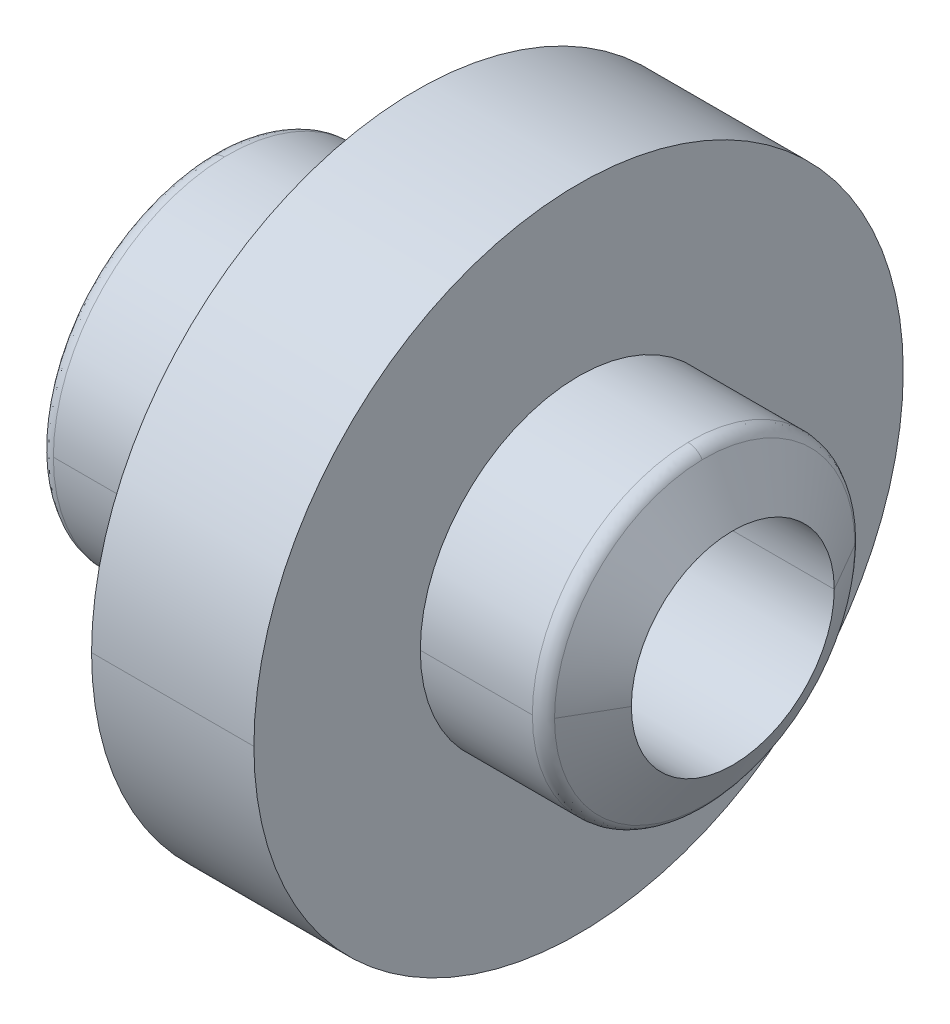
ISO-10303-21;
HEADER;
FILE_DESCRIPTION(('STEP AP214'),'2;1');
FILE_NAME('part.step','',(''),(''),'','','');
FILE_SCHEMA(('AUTOMOTIVE_DESIGN { 1 0 10303 214 1 1 1 1 }'));
ENDSEC;
DATA;
#1=APPLICATION_CONTEXT('core data for automotive mechanical design processes');
#2=APPLICATION_PROTOCOL_DEFINITION('international standard','automotive_design',2000,#1);
#3=PRODUCT_CONTEXT('',#1,'mechanical');
#4=PRODUCT('Part','Part','',(#3));
#5=PRODUCT_RELATED_PRODUCT_CATEGORY('part','',(#4));
#6=PRODUCT_DEFINITION_FORMATION('','',#4);
#7=PRODUCT_DEFINITION_CONTEXT('part definition',#1,'design');
#8=PRODUCT_DEFINITION('design','',#6,#7);
#9=PRODUCT_DEFINITION_SHAPE('','',#8);
#10=(LENGTH_UNIT() NAMED_UNIT(*) SI_UNIT(.MILLI.,.METRE.));
#11=(NAMED_UNIT(*) PLANE_ANGLE_UNIT() SI_UNIT($,.RADIAN.));
#12=(NAMED_UNIT(*) SI_UNIT($,.STERADIAN.) SOLID_ANGLE_UNIT());
#13=UNCERTAINTY_MEASURE_WITH_UNIT(LENGTH_MEASURE(1.E-05),#10,'distance_accuracy_value','');
#14=(GEOMETRIC_REPRESENTATION_CONTEXT(3) GLOBAL_UNCERTAINTY_ASSIGNED_CONTEXT((#13)) GLOBAL_UNIT_ASSIGNED_CONTEXT((#10,
#11,#12)) REPRESENTATION_CONTEXT('',''));
#15=CARTESIAN_POINT('',(0.,0.,0.));
#16=DIRECTION('',(0.,0.,1.));
#17=DIRECTION('',(1.,0.,0.));
#18=AXIS2_PLACEMENT_3D('',#15,#16,#17);
#19=CARTESIAN_POINT('',(-10.75,0.,0.));
#20=DIRECTION('',(1.,0.,0.));
#21=DIRECTION('',(0.,0.,-1.));
#22=AXIS2_PLACEMENT_3D('',#19,#20,#21);
#23=CYLINDRICAL_SURFACE('',#22,1.25);
#24=DIRECTION('',(1.,0.,0.));
#25=VECTOR('',#24,1.);
#26=CARTESIAN_POINT('',(-10.75,0.,1.25));
#27=LINE('',#26,#25);
#28=CARTESIAN_POINT('',(-8.8,0.,1.25));
#29=VERTEX_POINT('',#28);
#30=CARTESIAN_POINT('',(-7.3,0.,1.25));
#31=VERTEX_POINT('',#30);
#32=EDGE_CURVE('E247',#29,#31,#27,.T.);
#33=ORIENTED_EDGE('',*,*,#32,.F.);
#34=CARTESIAN_POINT('',(-8.8,0.,0.));
#35=DIRECTION('',(1.,0.,0.));
#36=DIRECTION('',(0.,0.,-1.));
#37=AXIS2_PLACEMENT_3D('',#34,#35,#36);
#38=CIRCLE('',#37,1.25);
#39=CARTESIAN_POINT('',(-8.8,0.,-1.25));
#40=VERTEX_POINT('',#39);
#41=EDGE_CURVE('E11',#40,#29,#38,.T.);
#42=ORIENTED_EDGE('',*,*,#41,.F.);
#43=DIRECTION('',(1.,0.,0.));
#44=VECTOR('',#43,1.);
#45=CARTESIAN_POINT('',(-10.75,0.,-1.25));
#46=LINE('',#45,#44);
#47=CARTESIAN_POINT('',(-7.3,0.,-1.25));
#48=VERTEX_POINT('',#47);
#49=EDGE_CURVE('E219',#40,#48,#46,.T.);
#50=ORIENTED_EDGE('',*,*,#49,.T.);
#51=CARTESIAN_POINT('',(-7.3,0.,0.));
#52=DIRECTION('',(1.,0.,0.));
#53=DIRECTION('',(0.,0.,-1.));
#54=AXIS2_PLACEMENT_3D('',#51,#52,#53);
#55=CIRCLE('',#54,1.25);
#56=EDGE_CURVE('E28',#48,#31,#55,.T.);
#57=ORIENTED_EDGE('',*,*,#56,.T.);
#58=EDGE_LOOP('',(#33,#42,#50,#57));
#59=FACE_BOUND('',#58,.T.);
#60=ADVANCED_FACE('F17',(#59),#23,.F.);
#61=CARTESIAN_POINT('',(-8.8,0.,0.));
#62=DIRECTION('',(1.,0.,0.));
#63=DIRECTION('',(0.,1.,0.));
#64=AXIS2_PLACEMENT_3D('',#61,#62,#63);
#65=PLANE('',#64);
#66=CARTESIAN_POINT('',(-8.8,0.,0.));
#67=DIRECTION('',(-1.,0.,0.));
#68=DIRECTION('',(0.,0.,-1.));
#69=AXIS2_PLACEMENT_3D('',#66,#67,#68);
#70=CIRCLE('',#69,1.);
#71=CARTESIAN_POINT('',(-8.8,0.,-1.));
#72=VERTEX_POINT('',#71);
#73=CARTESIAN_POINT('',(-8.8,0.,1.));
#74=VERTEX_POINT('',#73);
#75=EDGE_CURVE('E372',#72,#74,#70,.T.);
#76=ORIENTED_EDGE('',*,*,#75,.T.);
#77=CARTESIAN_POINT('',(-8.8,0.,0.));
#78=DIRECTION('',(-1.,0.,0.));
#79=DIRECTION('',(0.,0.,-1.));
#80=AXIS2_PLACEMENT_3D('',#77,#78,#79);
#81=CIRCLE('',#80,1.);
#82=EDGE_CURVE('E299',#74,#72,#81,.T.);
#83=ORIENTED_EDGE('',*,*,#82,.T.);
#84=EDGE_LOOP('',(#76,#83));
#85=FACE_BOUND('',#84,.T.);
#86=ORIENTED_EDGE('',*,*,#41,.T.);
#87=CARTESIAN_POINT('',(-8.8,0.,0.));
#88=DIRECTION('',(1.,0.,0.));
#89=DIRECTION('',(0.,0.,-1.));
#90=AXIS2_PLACEMENT_3D('',#87,#88,#89);
#91=CIRCLE('',#90,1.25);
#92=EDGE_CURVE('E243',#29,#40,#91,.T.);
#93=ORIENTED_EDGE('',*,*,#92,.T.);
#94=EDGE_LOOP('',(#86,#93));
#95=FACE_BOUND('',#94,.T.);
#96=ADVANCED_FACE('F643',(#85,#95),#65,.T.);
#97=CARTESIAN_POINT('',(-7.3,0.,0.));
#98=DIRECTION('',(1.,0.,0.));
#99=DIRECTION('',(0.,1.,0.));
#100=AXIS2_PLACEMENT_3D('',#97,#98,#99);
#101=PLANE('',#100);
#102=CARTESIAN_POINT('',(-7.3,0.,0.));
#103=DIRECTION('',(1.,0.,0.));
#104=DIRECTION('',(0.,0.,-1.));
#105=AXIS2_PLACEMENT_3D('',#102,#103,#104);
#106=CIRCLE('',#105,1.);
#107=CARTESIAN_POINT('',(-7.3,0.,-1.));
#108=VERTEX_POINT('',#107);
#109=CARTESIAN_POINT('',(-7.3,0.,1.));
#110=VERTEX_POINT('',#109);
#111=EDGE_CURVE('E256',#108,#110,#106,.T.);
#112=ORIENTED_EDGE('',*,*,#111,.T.);
#113=CARTESIAN_POINT('',(-7.3,0.,0.));
#114=DIRECTION('',(1.,0.,0.));
#115=DIRECTION('',(0.,0.,-1.));
#116=AXIS2_PLACEMENT_3D('',#113,#114,#115);
#117=CIRCLE('',#116,1.);
#118=EDGE_CURVE('E397',#110,#108,#117,.T.);
#119=ORIENTED_EDGE('',*,*,#118,.T.);
#120=EDGE_LOOP('',(#112,#119));
#121=FACE_BOUND('',#120,.T.);
#122=ORIENTED_EDGE('',*,*,#56,.F.);
#123=CARTESIAN_POINT('',(-7.3,0.,0.));
#124=DIRECTION('',(1.,0.,0.));
#125=DIRECTION('',(0.,0.,-1.));
#126=AXIS2_PLACEMENT_3D('',#123,#124,#125);
#127=CIRCLE('',#126,1.25);
#128=EDGE_CURVE('E354',#31,#48,#127,.T.);
#129=ORIENTED_EDGE('',*,*,#128,.F.);
#130=EDGE_LOOP('',(#122,#129));
#131=FACE_BOUND('',#130,.T.);
#132=ADVANCED_FACE('F500',(#121,#131),#101,.F.);
#133=CARTESIAN_POINT('',(-10.75,0.,0.));
#134=DIRECTION('',(1.,0.,0.));
#135=DIRECTION('',(0.,0.,-1.));
#136=AXIS2_PLACEMENT_3D('',#133,#134,#135);
#137=CYLINDRICAL_SURFACE('',#136,1.);
#138=DIRECTION('',(1.,0.,0.));
#139=VECTOR('',#138,1.);
#140=CARTESIAN_POINT('',(-10.75,0.,1.));
#141=LINE('',#140,#139);
#142=CARTESIAN_POINT('',(-10.4000000000042,0.,0.999999999976353));
#143=VERTEX_POINT('',#142);
#144=EDGE_CURVE('E145',#143,#74,#141,.T.);
#145=ORIENTED_EDGE('',*,*,#144,.F.);
#146=CARTESIAN_POINT('',(-10.4000000000042,0.,0.));
#147=DIRECTION('',(1.,0.,0.));
#148=DIRECTION('',(0.,-1.,0.));
#149=AXIS2_PLACEMENT_3D('',#146,#147,#148);
#150=CIRCLE('',#149,0.999999999976353);
#151=CARTESIAN_POINT('',(-10.4000000000042,0.,-0.999999999976353));
#152=VERTEX_POINT('',#151);
#153=EDGE_CURVE('E277',#152,#143,#150,.T.);
#154=ORIENTED_EDGE('',*,*,#153,.F.);
#155=DIRECTION('',(1.,0.,0.));
#156=VECTOR('',#155,1.);
#157=CARTESIAN_POINT('',(-10.75,0.,-1.));
#158=LINE('',#157,#156);
#159=EDGE_CURVE('E248',#152,#72,#158,.T.);
#160=ORIENTED_EDGE('',*,*,#159,.T.);
#161=ORIENTED_EDGE('',*,*,#82,.F.);
#162=EDGE_LOOP('',(#145,#154,#160,#161));
#163=FACE_BOUND('',#162,.T.);
#164=ADVANCED_FACE('F782',(#163),#137,.F.);
#165=CARTESIAN_POINT('',(-10.75,0.,0.));
#166=DIRECTION('',(1.,0.,0.));
#167=DIRECTION('',(0.,0.,-1.));
#168=AXIS2_PLACEMENT_3D('',#165,#166,#167);
#169=CYLINDRICAL_SURFACE('',#168,1.);
#170=DIRECTION('',(1.,0.,0.));
#171=VECTOR('',#170,1.);
#172=CARTESIAN_POINT('',(-10.75,0.,1.));
#173=LINE('',#172,#171);
#174=CARTESIAN_POINT('',(-5.8,0.,1.));
#175=VERTEX_POINT('',#174);
#176=EDGE_CURVE('E482',#110,#175,#173,.T.);
#177=ORIENTED_EDGE('',*,*,#176,.F.);
#178=ORIENTED_EDGE('',*,*,#111,.F.);
#179=DIRECTION('',(1.,0.,0.));
#180=VECTOR('',#179,1.);
#181=CARTESIAN_POINT('',(-10.75,0.,-1.));
#182=LINE('',#181,#180);
#183=CARTESIAN_POINT('',(-5.8,0.,-1.));
#184=VERTEX_POINT('',#183);
#185=EDGE_CURVE('E339',#108,#184,#182,.T.);
#186=ORIENTED_EDGE('',*,*,#185,.T.);
#187=CARTESIAN_POINT('',(-5.8,0.,0.));
#188=DIRECTION('',(-1.,0.,0.));
#189=DIRECTION('',(0.,0.,-1.));
#190=AXIS2_PLACEMENT_3D('',#187,#188,#189);
#191=CIRCLE('',#190,1.);
#192=EDGE_CURVE('E254',#175,#184,#191,.T.);
#193=ORIENTED_EDGE('',*,*,#192,.F.);
#194=EDGE_LOOP('',(#177,#178,#186,#193));
#195=FACE_BOUND('',#194,.T.);
#196=ADVANCED_FACE('F498',(#195),#169,.F.);
#197=CARTESIAN_POINT('',(-9.79378226065819,0.,0.));
#198=DIRECTION('',(1.,0.,0.));
#199=DIRECTION('',(0.,0.,-1.));
#200=AXIS2_PLACEMENT_3D('',#197,#198,#199);
#201=CONICAL_SURFACE('',#200,2.04999992496368,1.04719755119269);
#202=DIRECTION('',(0.500000000003384,0.,0.866025403782485));
#203=VECTOR('',#202,1.);
#204=CARTESIAN_POINT('',(-9.79378226065819,0.,2.04999992496368));
#205=LINE('',#204,#203);
#206=CARTESIAN_POINT('',(-9.7937822606828,0.,2.04999992492105));
#207=VERTEX_POINT('',#206);
#208=EDGE_CURVE('E285',#143,#207,#205,.T.);
#209=ORIENTED_EDGE('',*,*,#208,.F.);
#210=CARTESIAN_POINT('',(-10.4000000000042,0.,0.));
#211=DIRECTION('',(1.,0.,0.));
#212=DIRECTION('',(0.,-1.,0.));
#213=AXIS2_PLACEMENT_3D('',#210,#211,#212);
#214=CIRCLE('',#213,0.999999999976353);
#215=EDGE_CURVE('E21',#143,#152,#214,.T.);
#216=ORIENTED_EDGE('',*,*,#215,.T.);
#217=DIRECTION('',(0.500000000003384,0.,-0.866025403782485));
#218=VECTOR('',#217,1.);
#219=CARTESIAN_POINT('',(-9.79378226065819,0.,-2.04999992496368));
#220=LINE('',#219,#218);
#221=CARTESIAN_POINT('',(-9.7937822606828,0.,-2.04999992492105));
#222=VERTEX_POINT('',#221);
#223=EDGE_CURVE('E471',#152,#222,#220,.T.);
#224=ORIENTED_EDGE('',*,*,#223,.T.);
#225=CARTESIAN_POINT('',(-9.7937822606828,0.,0.));
#226=DIRECTION('',(1.,0.,0.));
#227=DIRECTION('',(0.,0.999786175409975,0.0206785748806395));
#228=AXIS2_PLACEMENT_3D('',#225,#226,#227);
#229=CIRCLE('',#228,2.04999992494688);
#230=CARTESIAN_POINT('',(-9.7937822606828,-2.04956158455338,-0.0423910769533192));
#231=VERTEX_POINT('',#230);
#232=EDGE_CURVE('E296',#231,#222,#229,.T.);
#233=ORIENTED_EDGE('',*,*,#232,.F.);
#234=CARTESIAN_POINT('',(-9.7937822606828,0.,0.));
#235=DIRECTION('',(1.,0.,0.));
#236=DIRECTION('',(0.,0.999786175409975,0.0206785748806395));
#237=AXIS2_PLACEMENT_3D('',#234,#235,#236);
#238=CIRCLE('',#237,2.04999992494688);
#239=EDGE_CURVE('E129',#207,#231,#238,.T.);
#240=ORIENTED_EDGE('',*,*,#239,.F.);
#241=EDGE_LOOP('',(#209,#216,#224,#233,#240));
#242=FACE_BOUND('',#241,.T.);
#243=ADVANCED_FACE('F665',(#242),#201,.T.);
#244=CARTESIAN_POINT('',(-5.8,0.,0.));
#245=DIRECTION('',(1.,0.,0.));
#246=DIRECTION('',(0.,1.,0.));
#247=AXIS2_PLACEMENT_3D('',#244,#245,#246);
#248=PLANE('',#247);
#249=CARTESIAN_POINT('',(-5.8,0.,0.));
#250=DIRECTION('',(-1.,0.,0.));
#251=DIRECTION('',(0.,0.,-1.));
#252=AXIS2_PLACEMENT_3D('',#249,#250,#251);
#253=CIRCLE('',#252,1.);
#254=EDGE_CURVE('E343',#184,#175,#253,.T.);
#255=ORIENTED_EDGE('',*,*,#254,.T.);
#256=ORIENTED_EDGE('',*,*,#192,.T.);
#257=EDGE_LOOP('',(#255,#256));
#258=FACE_BOUND('',#257,.T.);
#259=CARTESIAN_POINT('',(-5.8,0.,0.));
#260=DIRECTION('',(1.,0.,0.));
#261=DIRECTION('',(0.,0.,-1.));
#262=AXIS2_PLACEMENT_3D('',#259,#260,#261);
#263=CIRCLE('',#262,1.25);
#264=CARTESIAN_POINT('',(-5.8,0.,-1.25));
#265=VERTEX_POINT('',#264);
#266=CARTESIAN_POINT('',(-5.8,0.,1.25));
#267=VERTEX_POINT('',#266);
#268=EDGE_CURVE('E265',#265,#267,#263,.T.);
#269=ORIENTED_EDGE('',*,*,#268,.T.);
#270=CARTESIAN_POINT('',(-5.8,0.,0.));
#271=DIRECTION('',(1.,0.,0.));
#272=DIRECTION('',(0.,0.,-1.));
#273=AXIS2_PLACEMENT_3D('',#270,#271,#272);
#274=CIRCLE('',#273,1.25);
#275=EDGE_CURVE('E241',#267,#265,#274,.T.);
#276=ORIENTED_EDGE('',*,*,#275,.T.);
#277=EDGE_LOOP('',(#269,#276));
#278=FACE_BOUND('',#277,.T.);
#279=ADVANCED_FACE('F264',(#258,#278),#248,.T.);
#280=CARTESIAN_POINT('',(-9.62057714906,2.14954027713144,0.0444589359933749));
#281=CARTESIAN_POINT('',(-9.62057714906,2.0606224051447,4.34353949025627));
#282=CARTESIAN_POINT('',(-9.62057714906,-2.23845814911819,4.25462161826952));
#283=CARTESIAN_POINT('',(-9.62057714906,-2.14954027713144,-0.0444589359933746));
#284=CARTESIAN_POINT('',(-9.69378225831557,2.14954027256955,0.0444589358990211));
#285=CARTESIAN_POINT('',(-9.69378225831557,2.06062240077151,4.34353948103812));
#286=CARTESIAN_POINT('',(-9.69378225831557,-2.23845814436759,4.25462160924008));
#287=CARTESIAN_POINT('',(-9.69378225831557,-2.14954027256955,-0.0444589358990209));
#288=CARTESIAN_POINT('',(-9.75717973354465,2.11294552875635,0.0437020469073639));
#289=CARTESIAN_POINT('',(-9.75717973354466,2.02554143494163,4.26959310442007));
#290=CARTESIAN_POINT('',(-9.75717973354466,-2.20034962257109,4.18218901060535));
#291=CARTESIAN_POINT('',(-9.75717973354465,-2.11294552875635,-0.0437020469073636));
#292=CARTESIAN_POINT('',(-9.79378226069398,2.04956158453402,0.0423910769529189));
#293=CARTESIAN_POINT('',(-9.79378226069398,1.96477943062818,4.14151424602095));
#294=CARTESIAN_POINT('',(-9.79378226069398,-2.13434373843985,4.05673209211511));
#295=CARTESIAN_POINT('',(-9.79378226069398,-2.04956158453402,-0.0423910769529186));
#296=(BOUNDED_SURFACE() B_SPLINE_SURFACE(3,3,((#280,#281,#282,#283),(#284,#285,#286,#287),(#288,
#289,#290,#291),(#292,#293,#294,#295)),.UNSPECIFIED.,.F.,.F.,
.F.) B_SPLINE_SURFACE_WITH_KNOTS((4,4),(4,4),(0.,1.),(0.,1.),
.UNSPECIFIED.) GEOMETRIC_REPRESENTATION_ITEM() RATIONAL_B_SPLINE_SURFACE(((1.,0.333333333333334,
0.333333333333334,1.),(0.910683540672758,0.303561180224252,0.303561180224252,0.910683540672758),
(0.910683540672758,0.303561180224252,0.303561180224252,0.910683540672758),(1.,0.333333333333334,
0.333333333333334,1.))) REPRESENTATION_ITEM('') SURFACE());
#297=CARTESIAN_POINT('',(-9.620577136594,-1.94958304204945,-0.0403232210172467));
#298=DIRECTION('',(0.,0.0206785748806394,-0.999786175409975));
#299=DIRECTION('',(0.,-0.999786175409975,-0.0206785748806394));
#300=AXIS2_PLACEMENT_3D('',#297,#298,#299);
#301=CIRCLE('',#300,0.2);
#302=CARTESIAN_POINT('',(-9.62057714906,-2.14954027713144,-0.0444589359933747));
#303=VERTEX_POINT('',#302);
#304=EDGE_CURVE('E363',#303,#231,#301,.T.);
#305=CARTESIAN_POINT('',(-9.62057714906,0.,0.));
#306=DIRECTION('',(1.,0.,0.));
#307=DIRECTION('',(0.,0.,-1.));
#308=AXIS2_PLACEMENT_3D('',#305,#306,#307);
#309=CIRCLE('',#308,2.15);
#310=CARTESIAN_POINT('',(-9.62057714906,0.,2.15));
#311=VERTEX_POINT('',#310);
#312=EDGE_CURVE('E378',#311,#303,#309,.T.);
#313=CARTESIAN_POINT('',(-9.62057714906,0.,0.));
#314=DIRECTION('',(1.,0.,0.));
#315=DIRECTION('',(0.,0.,-1.));
#316=AXIS2_PLACEMENT_3D('',#313,#314,#315);
#317=CIRCLE('',#316,2.15);
#318=CARTESIAN_POINT('',(-9.62057714906,2.14954027713144,0.0444589359933749));
#319=VERTEX_POINT('',#318);
#320=EDGE_CURVE('E359',#319,#311,#317,.T.);
#321=CARTESIAN_POINT('',(-9.620577136594,1.94958304204945,0.040323221017247));
#322=DIRECTION('',(0.,-0.0206785748806395,0.999786175409975));
#323=DIRECTION('',(0.,0.999786175409975,0.0206785748806395));
#324=AXIS2_PLACEMENT_3D('',#321,#322,#323);
#325=CIRCLE('',#324,0.2);
#326=CARTESIAN_POINT('',(-9.7937822606828,2.04956158455338,0.0423910769533195));
#327=VERTEX_POINT('',#326);
#328=EDGE_CURVE('E295',#319,#327,#325,.T.);
#329=CARTESIAN_POINT('',(-9.7937822606828,0.,0.));
#330=DIRECTION('',(1.,0.,0.));
#331=DIRECTION('',(0.,0.999786175409975,0.0206785748806395));
#332=AXIS2_PLACEMENT_3D('',#329,#330,#331);
#333=CIRCLE('',#332,2.04999992494688);
#334=EDGE_CURVE('E334',#327,#207,#333,.T.);
#335=ORIENTED_EDGE('',*,*,#304,.F.);
#336=ORIENTED_EDGE('',*,*,#312,.F.);
#337=ORIENTED_EDGE('',*,*,#320,.F.);
#338=ORIENTED_EDGE('',*,*,#328,.T.);
#339=ORIENTED_EDGE('',*,*,#334,.T.);
#340=ORIENTED_EDGE('',*,*,#239,.T.);
#341=EDGE_LOOP('',(#335,#336,#337,#338,#339,#340));
#342=FACE_BOUND('',#341,.T.);
#343=ADVANCED_FACE('F652',(#342),#296,.T.);
#344=CARTESIAN_POINT('',(-10.75,0.,0.));
#345=DIRECTION('',(1.,0.,0.));
#346=DIRECTION('',(0.,0.,-1.));
#347=AXIS2_PLACEMENT_3D('',#344,#345,#346);
#348=CYLINDRICAL_SURFACE('',#347,1.25);
#349=DIRECTION('',(1.,0.,0.));
#350=VECTOR('',#349,1.);
#351=CARTESIAN_POINT('',(-10.75,0.,1.25));
#352=LINE('',#351,#350);
#353=CARTESIAN_POINT('',(-3.39999999999918,0.,1.25000000002728));
#354=VERTEX_POINT('',#353);
#355=EDGE_CURVE('E249',#267,#354,#352,.T.);
#356=ORIENTED_EDGE('',*,*,#355,.F.);
#357=ORIENTED_EDGE('',*,*,#268,.F.);
#358=DIRECTION('',(1.,0.,0.));
#359=VECTOR('',#358,1.);
#360=CARTESIAN_POINT('',(-10.75,0.,-1.25));
#361=LINE('',#360,#359);
#362=CARTESIAN_POINT('',(-3.39999999999918,0.,-1.25000000002728));
#363=VERTEX_POINT('',#362);
#364=EDGE_CURVE('E272',#265,#363,#361,.T.);
#365=ORIENTED_EDGE('',*,*,#364,.T.);
#366=CARTESIAN_POINT('',(-3.39999999999918,0.,0.));
#367=DIRECTION('',(-1.,0.,0.));
#368=DIRECTION('',(0.,1.,0.));
#369=AXIS2_PLACEMENT_3D('',#366,#367,#368);
#370=CIRCLE('',#369,1.25000000002728);
#371=EDGE_CURVE('E408',#354,#363,#370,.T.);
#372=ORIENTED_EDGE('',*,*,#371,.F.);
#373=EDGE_LOOP('',(#356,#357,#365,#372));
#374=FACE_BOUND('',#373,.T.);
#375=ADVANCED_FACE('F656',(#374),#348,.F.);
#376=CARTESIAN_POINT('',(-10.75,0.,0.));
#377=DIRECTION('',(1.,0.,0.));
#378=DIRECTION('',(0.,0.,-1.));
#379=AXIS2_PLACEMENT_3D('',#376,#377,#378);
#380=CYLINDRICAL_SURFACE('',#379,2.15);
#381=DIRECTION('',(1.,0.,0.));
#382=VECTOR('',#381,1.);
#383=CARTESIAN_POINT('',(-10.75,0.,2.15));
#384=LINE('',#383,#382);
#385=CARTESIAN_POINT('',(-7.3,0.,2.15));
#386=VERTEX_POINT('',#385);
#387=EDGE_CURVE('E325',#311,#386,#384,.T.);
#388=ORIENTED_EDGE('',*,*,#387,.F.);
#389=ORIENTED_EDGE('',*,*,#312,.T.);
#390=CARTESIAN_POINT('',(-9.62057714906,0.,0.));
#391=DIRECTION('',(1.,0.,0.));
#392=DIRECTION('',(0.,0.,-1.));
#393=AXIS2_PLACEMENT_3D('',#390,#391,#392);
#394=CIRCLE('',#393,2.15);
#395=CARTESIAN_POINT('',(-9.62057714906,0.,-2.15));
#396=VERTEX_POINT('',#395);
#397=EDGE_CURVE('E320',#303,#396,#394,.T.);
#398=ORIENTED_EDGE('',*,*,#397,.T.);
#399=DIRECTION('',(1.,0.,0.));
#400=VECTOR('',#399,1.);
#401=CARTESIAN_POINT('',(-10.75,0.,-2.15));
#402=LINE('',#401,#400);
#403=CARTESIAN_POINT('',(-7.3,0.,-2.15));
#404=VERTEX_POINT('',#403);
#405=EDGE_CURVE('E238',#396,#404,#402,.T.);
#406=ORIENTED_EDGE('',*,*,#405,.T.);
#407=CARTESIAN_POINT('',(-7.3,0.,0.));
#408=DIRECTION('',(-1.,0.,0.));
#409=DIRECTION('',(0.,0.,-1.));
#410=AXIS2_PLACEMENT_3D('',#407,#408,#409);
#411=CIRCLE('',#410,2.15);
#412=EDGE_CURVE('E315',#404,#386,#411,.T.);
#413=ORIENTED_EDGE('',*,*,#412,.T.);
#414=EDGE_LOOP('',(#388,#389,#398,#406,#413));
#415=FACE_BOUND('',#414,.T.);
#416=ADVANCED_FACE('F19',(#415),#380,.T.);
#417=CARTESIAN_POINT('',(-3.74641012990651,0.,0.));
#418=DIRECTION('',(-1.,0.,0.));
#419=DIRECTION('',(0.,0.,1.));
#420=AXIS2_PLACEMENT_3D('',#417,#418,#419);
#421=CONICAL_SURFACE('',#420,1.84999994525014,1.04719755117267);
#422=DIRECTION('',(-0.500000000020726,0.,-0.866025403772473));
#423=VECTOR('',#422,1.);
#424=CARTESIAN_POINT('',(-3.74641012990651,0.,-1.84999994525014));
#425=LINE('',#424,#423);
#426=CARTESIAN_POINT('',(-3.74641012987928,0.,-1.84999994520299));
#427=VERTEX_POINT('',#426);
#428=EDGE_CURVE('E330',#363,#427,#425,.T.);
#429=ORIENTED_EDGE('',*,*,#428,.F.);
#430=CARTESIAN_POINT('',(-3.39999999999918,0.,0.));
#431=DIRECTION('',(-1.,0.,0.));
#432=DIRECTION('',(0.,1.,0.));
#433=AXIS2_PLACEMENT_3D('',#430,#431,#432);
#434=CIRCLE('',#433,1.25000000002728);
#435=EDGE_CURVE('E253',#363,#354,#434,.T.);
#436=ORIENTED_EDGE('',*,*,#435,.T.);
#437=DIRECTION('',(-0.500000000020726,0.,0.866025403772472));
#438=VECTOR('',#437,1.);
#439=CARTESIAN_POINT('',(-3.74641012990651,0.,1.84999994525014));
#440=LINE('',#439,#438);
#441=CARTESIAN_POINT('',(-3.74641012987928,0.,1.84999994520299));
#442=VERTEX_POINT('',#441);
#443=EDGE_CURVE('E329',#354,#442,#440,.T.);
#444=ORIENTED_EDGE('',*,*,#443,.T.);
#445=CARTESIAN_POINT('',(-3.74641012987928,0.,0.));
#446=DIRECTION('',(-1.,0.,0.));
#447=DIRECTION('',(0.,0.999860506194564,0.0167023397267994));
#448=AXIS2_PLACEMENT_3D('',#445,#446,#447);
#449=CIRCLE('',#448,1.84999994520684);
#450=CARTESIAN_POINT('',(-3.74641012987928,-1.84974188167443,-0.0308993275794047));
#451=VERTEX_POINT('',#450);
#452=EDGE_CURVE('E312',#451,#442,#449,.T.);
#453=ORIENTED_EDGE('',*,*,#452,.F.);
#454=CARTESIAN_POINT('',(-3.74641012987928,0.,0.));
#455=DIRECTION('',(-1.,0.,0.));
#456=DIRECTION('',(0.,0.999860506194564,0.0167023397268003));
#457=AXIS2_PLACEMENT_3D('',#454,#455,#456);
#458=CIRCLE('',#457,1.84999994520684);
#459=EDGE_CURVE('E405',#427,#451,#458,.T.);
#460=ORIENTED_EDGE('',*,*,#459,.F.);
#461=EDGE_LOOP('',(#429,#436,#444,#453,#460));
#462=FACE_BOUND('',#461,.T.);
#463=ADVANCED_FACE('F460',(#462),#421,.T.);
#464=CARTESIAN_POINT('',(-7.3,0.,0.));
#465=DIRECTION('',(1.,0.,0.));
#466=DIRECTION('',(0.,1.,0.));
#467=AXIS2_PLACEMENT_3D('',#464,#465,#466);
#468=PLANE('',#467);
#469=ORIENTED_EDGE('',*,*,#412,.F.);
#470=CARTESIAN_POINT('',(-7.3,0.,0.));
#471=DIRECTION('',(-1.,0.,0.));
#472=DIRECTION('',(0.,0.,-1.));
#473=AXIS2_PLACEMENT_3D('',#470,#471,#472);
#474=CIRCLE('',#473,2.15);
#475=EDGE_CURVE('E242',#386,#404,#474,.T.);
#476=ORIENTED_EDGE('',*,*,#475,.F.);
#477=EDGE_LOOP('',(#469,#476));
#478=FACE_BOUND('',#477,.T.);
#479=CARTESIAN_POINT('',(-7.3,0.,0.));
#480=DIRECTION('',(1.,0.,0.));
#481=DIRECTION('',(0.,0.,-1.));
#482=AXIS2_PLACEMENT_3D('',#479,#480,#481);
#483=CIRCLE('',#482,4.);
#484=CARTESIAN_POINT('',(-7.3,0.,-4.));
#485=VERTEX_POINT('',#484);
#486=CARTESIAN_POINT('',(-7.3,0.,4.));
#487=VERTEX_POINT('',#486);
#488=EDGE_CURVE('E227',#485,#487,#483,.T.);
#489=ORIENTED_EDGE('',*,*,#488,.F.);
#490=CARTESIAN_POINT('',(-7.3,0.,0.));
#491=DIRECTION('',(1.,0.,0.));
#492=DIRECTION('',(0.,0.,-1.));
#493=AXIS2_PLACEMENT_3D('',#490,#491,#492);
#494=CIRCLE('',#493,4.);
#495=EDGE_CURVE('E199',#487,#485,#494,.T.);
#496=ORIENTED_EDGE('',*,*,#495,.F.);
#497=EDGE_LOOP('',(#489,#496));
#498=FACE_BOUND('',#497,.T.);
#499=ADVANCED_FACE('F728',(#478,#498),#468,.F.);
#500=CARTESIAN_POINT('',(-3.74641012987761,1.84974188167153,0.0308993275793566));
#501=CARTESIAN_POINT('',(-3.74641012987761,1.78794322651282,3.73038309092243));
#502=CARTESIAN_POINT('',(-3.74641012987761,-1.91154053683025,3.66858443576371));
#503=CARTESIAN_POINT('',(-3.74641012987761,-1.84974188167153,-0.0308993275793564));
#504=CARTESIAN_POINT('',(-3.78301266029534,1.91313052680276,0.0319582139732525));
#505=CARTESIAN_POINT('',(-3.78301266029534,1.84921409885626,3.85821926757878));
#506=CARTESIAN_POINT('',(-3.78301266029534,-1.97704695474927,3.79430283963228));
#507=CARTESIAN_POINT('',(-3.78301266029534,-1.91313052680276,-0.0319582139732523));
#508=CARTESIAN_POINT('',(-3.84641013063603,1.9497279831686,0.0325695624019301));
#509=CARTESIAN_POINT('',(-3.84641013063603,1.88458885836474,3.93202552873913));
#510=CARTESIAN_POINT('',(-3.84641013063603,-2.01486710797246,3.86688640393527));
#511=CARTESIAN_POINT('',(-3.84641013063603,-1.9497279831686,-0.0325695624019299));
#512=CARTESIAN_POINT('',(-3.919615231585,1.9497279870794,0.0325695624672589));
#513=CARTESIAN_POINT('',(-3.919615231585,1.88458886214488,3.93202553662605));
#514=CARTESIAN_POINT('',(-3.919615231585,-2.01486711201392,3.86688641169154));
#515=CARTESIAN_POINT('',(-3.919615231585,-1.9497279870794,-0.0325695624672586));
#516=(BOUNDED_SURFACE() B_SPLINE_SURFACE(3,3,((#500,#501,#502,#503),(#504,#505,#506,#507),(#508,
#509,#510,#511),(#512,#513,#514,#515)),.UNSPECIFIED.,.F.,.F.,
.F.) B_SPLINE_SURFACE_WITH_KNOTS((4,4),(4,4),(0.,1.),(0.,1.),
.UNSPECIFIED.) GEOMETRIC_REPRESENTATION_ITEM() RATIONAL_B_SPLINE_SURFACE(((1.,0.333333333333334,
0.333333333333334,1.),(0.910683558700433,0.303561186233477,0.303561186233477,0.910683558700433),
(0.910683558700433,0.303561186233477,0.303561186233477,0.910683558700433),(1.,0.333333333333334,
0.333333333333334,1.))) REPRESENTATION_ITEM('') SURFACE());
#517=CARTESIAN_POINT('',(-3.919615242271,-1.74975588584049,-0.0292290945218987));
#518=DIRECTION('',(0.,0.0167023397267992,-0.999860506194564));
#519=DIRECTION('',(0.,-0.999860506194564,-0.0167023397267992));
#520=AXIS2_PLACEMENT_3D('',#517,#518,#519);
#521=CIRCLE('',#520,0.2);
#522=CARTESIAN_POINT('',(-3.919615231585,-1.9497279870794,-0.0325695624672586));
#523=VERTEX_POINT('',#522);
#524=EDGE_CURVE('E401',#451,#523,#521,.T.);
#525=CARTESIAN_POINT('',(-3.74641012987928,0.,0.));
#526=DIRECTION('',(-1.,0.,0.));
#527=DIRECTION('',(0.,0.999860506194564,0.0167023397267985));
#528=AXIS2_PLACEMENT_3D('',#525,#526,#527);
#529=CIRCLE('',#528,1.84999994520684);
#530=CARTESIAN_POINT('',(-3.74641012987928,1.84974188167443,0.030899327579405));
#531=VERTEX_POINT('',#530);
#532=EDGE_CURVE('E326',#442,#531,#529,.T.);
#533=CARTESIAN_POINT('',(-3.919615242271,1.74975588584049,0.0292290945218989));
#534=DIRECTION('',(0.,-0.0167023397267994,0.999860506194564));
#535=DIRECTION('',(0.,0.999860506194564,0.0167023397267994));
#536=AXIS2_PLACEMENT_3D('',#533,#534,#535);
#537=CIRCLE('',#536,0.2);
#538=CARTESIAN_POINT('',(-3.919615231585,1.9497279870794,0.0325695624672589));
#539=VERTEX_POINT('',#538);
#540=EDGE_CURVE('E321',#531,#539,#537,.T.);
#541=CARTESIAN_POINT('',(-3.919615231585,0.,0.));
#542=DIRECTION('',(-1.,0.,0.));
#543=DIRECTION('',(0.,0.,-1.));
#544=AXIS2_PLACEMENT_3D('',#541,#542,#543);
#545=CIRCLE('',#544,1.95);
#546=CARTESIAN_POINT('',(-3.919615231585,0.,1.95));
#547=VERTEX_POINT('',#546);
#548=EDGE_CURVE('E308',#547,#539,#545,.T.);
#549=CARTESIAN_POINT('',(-3.919615231585,0.,0.));
#550=DIRECTION('',(-1.,0.,0.));
#551=DIRECTION('',(0.,0.,-1.));
#552=AXIS2_PLACEMENT_3D('',#549,#550,#551);
#553=CIRCLE('',#552,1.95);
#554=EDGE_CURVE('E413',#523,#547,#553,.T.);
#555=ORIENTED_EDGE('',*,*,#524,.F.);
#556=ORIENTED_EDGE('',*,*,#452,.T.);
#557=ORIENTED_EDGE('',*,*,#532,.T.);
#558=ORIENTED_EDGE('',*,*,#540,.T.);
#559=ORIENTED_EDGE('',*,*,#548,.F.);
#560=ORIENTED_EDGE('',*,*,#554,.F.);
#561=EDGE_LOOP('',(#555,#556,#557,#558,#559,#560));
#562=FACE_BOUND('',#561,.T.);
#563=ADVANCED_FACE('F440',(#562),#516,.T.);
#564=CARTESIAN_POINT('',(-10.75,0.,0.));
#565=DIRECTION('',(1.,0.,0.));
#566=DIRECTION('',(0.,0.,-1.));
#567=AXIS2_PLACEMENT_3D('',#564,#565,#566);
#568=CYLINDRICAL_SURFACE('',#567,4.);
#569=DIRECTION('',(1.,0.,0.));
#570=VECTOR('',#569,1.);
#571=CARTESIAN_POINT('',(-10.75,0.,4.));
#572=LINE('',#571,#570);
#573=CARTESIAN_POINT('',(-5.3,0.,4.));
#574=VERTEX_POINT('',#573);
#575=EDGE_CURVE('E211',#487,#574,#572,.T.);
#576=ORIENTED_EDGE('',*,*,#575,.F.);
#577=ORIENTED_EDGE('',*,*,#495,.T.);
#578=DIRECTION('',(1.,0.,0.));
#579=VECTOR('',#578,1.);
#580=CARTESIAN_POINT('',(-10.75,0.,-4.));
#581=LINE('',#580,#579);
#582=CARTESIAN_POINT('',(-5.3,0.,-4.));
#583=VERTEX_POINT('',#582);
#584=EDGE_CURVE('E214',#485,#583,#581,.T.);
#585=ORIENTED_EDGE('',*,*,#584,.T.);
#586=CARTESIAN_POINT('',(-5.3,0.,0.));
#587=DIRECTION('',(1.,0.,0.));
#588=DIRECTION('',(0.,0.,-1.));
#589=AXIS2_PLACEMENT_3D('',#586,#587,#588);
#590=CIRCLE('',#589,4.);
#591=EDGE_CURVE('E207',#574,#583,#590,.T.);
#592=ORIENTED_EDGE('',*,*,#591,.F.);
#593=EDGE_LOOP('',(#576,#577,#585,#592));
#594=FACE_BOUND('',#593,.T.);
#595=ADVANCED_FACE('F209',(#594),#568,.T.);
#596=CARTESIAN_POINT('',(-10.75,0.,0.));
#597=DIRECTION('',(1.,0.,0.));
#598=DIRECTION('',(0.,0.,-1.));
#599=AXIS2_PLACEMENT_3D('',#596,#597,#598);
#600=CYLINDRICAL_SURFACE('',#599,1.95);
#601=DIRECTION('',(1.,0.,0.));
#602=VECTOR('',#601,1.);
#603=CARTESIAN_POINT('',(-10.75,0.,1.95));
#604=LINE('',#603,#602);
#605=CARTESIAN_POINT('',(-5.3,0.,1.95));
#606=VERTEX_POINT('',#605);
#607=EDGE_CURVE('E304',#606,#547,#604,.T.);
#608=ORIENTED_EDGE('',*,*,#607,.F.);
#609=CARTESIAN_POINT('',(-5.3,0.,0.));
#610=DIRECTION('',(-1.,0.,0.));
#611=DIRECTION('',(0.,0.,-1.));
#612=AXIS2_PLACEMENT_3D('',#609,#610,#611);
#613=CIRCLE('',#612,1.95);
#614=CARTESIAN_POINT('',(-5.3,0.,-1.95));
#615=VERTEX_POINT('',#614);
#616=EDGE_CURVE('E218',#615,#606,#613,.T.);
#617=ORIENTED_EDGE('',*,*,#616,.F.);
#618=DIRECTION('',(1.,0.,0.));
#619=VECTOR('',#618,1.);
#620=CARTESIAN_POINT('',(-10.75,0.,-1.95));
#621=LINE('',#620,#619);
#622=CARTESIAN_POINT('',(-3.919615231585,0.,-1.95));
#623=VERTEX_POINT('',#622);
#624=EDGE_CURVE('E234',#615,#623,#621,.T.);
#625=ORIENTED_EDGE('',*,*,#624,.T.);
#626=CARTESIAN_POINT('',(-3.919615231585,0.,0.));
#627=DIRECTION('',(-1.,0.,0.));
#628=DIRECTION('',(0.,0.,-1.));
#629=AXIS2_PLACEMENT_3D('',#626,#627,#628);
#630=CIRCLE('',#629,1.95);
#631=EDGE_CURVE('E367',#623,#523,#630,.T.);
#632=ORIENTED_EDGE('',*,*,#631,.T.);
#633=ORIENTED_EDGE('',*,*,#554,.T.);
#634=EDGE_LOOP('',(#608,#617,#625,#632,#633));
#635=FACE_BOUND('',#634,.T.);
#636=ADVANCED_FACE('F425',(#635),#600,.T.);
#637=CARTESIAN_POINT('',(-5.3,0.,0.));
#638=DIRECTION('',(1.,0.,0.));
#639=DIRECTION('',(0.,1.,0.));
#640=AXIS2_PLACEMENT_3D('',#637,#638,#639);
#641=PLANE('',#640);
#642=ORIENTED_EDGE('',*,*,#616,.T.);
#643=CARTESIAN_POINT('',(-5.3,0.,0.));
#644=DIRECTION('',(-1.,0.,0.));
#645=DIRECTION('',(0.,0.,-1.));
#646=AXIS2_PLACEMENT_3D('',#643,#644,#645);
#647=CIRCLE('',#646,1.95);
#648=EDGE_CURVE('E309',#606,#615,#647,.T.);
#649=ORIENTED_EDGE('',*,*,#648,.T.);
#650=EDGE_LOOP('',(#642,#649));
#651=FACE_BOUND('',#650,.T.);
#652=CARTESIAN_POINT('',(-5.3,0.,0.));
#653=DIRECTION('',(1.,0.,0.));
#654=DIRECTION('',(0.,0.,-1.));
#655=AXIS2_PLACEMENT_3D('',#652,#653,#654);
#656=CIRCLE('',#655,4.);
#657=EDGE_CURVE('E221',#583,#574,#656,.T.);
#658=ORIENTED_EDGE('',*,*,#657,.T.);
#659=ORIENTED_EDGE('',*,*,#591,.T.);
#660=EDGE_LOOP('',(#658,#659));
#661=FACE_BOUND('',#660,.T.);
#662=ADVANCED_FACE('F222',(#651,#661),#641,.T.);
#663=CARTESIAN_POINT('',(-10.75,0.,0.));
#664=DIRECTION('',(1.,0.,0.));
#665=DIRECTION('',(0.,0.,-1.));
#666=AXIS2_PLACEMENT_3D('',#663,#664,#665);
#667=CYLINDRICAL_SURFACE('',#666,1.25);
#668=ORIENTED_EDGE('',*,*,#92,.F.);
#669=ORIENTED_EDGE('',*,*,#32,.T.);
#670=ORIENTED_EDGE('',*,*,#128,.T.);
#671=ORIENTED_EDGE('',*,*,#49,.F.);
#672=EDGE_LOOP('',(#668,#669,#670,#671));
#673=FACE_BOUND('',#672,.T.);
#674=ADVANCED_FACE('F688',(#673),#667,.F.);
#675=CARTESIAN_POINT('',(-10.75,0.,0.));
#676=DIRECTION('',(1.,0.,0.));
#677=DIRECTION('',(0.,0.,-1.));
#678=AXIS2_PLACEMENT_3D('',#675,#676,#677);
#679=CYLINDRICAL_SURFACE('',#678,1.);
#680=ORIENTED_EDGE('',*,*,#215,.F.);
#681=ORIENTED_EDGE('',*,*,#144,.T.);
#682=ORIENTED_EDGE('',*,*,#75,.F.);
#683=ORIENTED_EDGE('',*,*,#159,.F.);
#684=EDGE_LOOP('',(#680,#681,#682,#683));
#685=FACE_BOUND('',#684,.T.);
#686=ADVANCED_FACE('F684',(#685),#679,.F.);
#687=CARTESIAN_POINT('',(-10.75,0.,0.));
#688=DIRECTION('',(1.,0.,0.));
#689=DIRECTION('',(0.,0.,-1.));
#690=AXIS2_PLACEMENT_3D('',#687,#688,#689);
#691=CYLINDRICAL_SURFACE('',#690,1.);
#692=ORIENTED_EDGE('',*,*,#118,.F.);
#693=ORIENTED_EDGE('',*,*,#176,.T.);
#694=ORIENTED_EDGE('',*,*,#254,.F.);
#695=ORIENTED_EDGE('',*,*,#185,.F.);
#696=EDGE_LOOP('',(#692,#693,#694,#695));
#697=FACE_BOUND('',#696,.T.);
#698=ADVANCED_FACE('F495',(#697),#691,.F.);
#699=CARTESIAN_POINT('',(-9.79378226065819,0.,0.));
#700=DIRECTION('',(1.,0.,0.));
#701=DIRECTION('',(0.,0.,-1.));
#702=AXIS2_PLACEMENT_3D('',#699,#700,#701);
#703=CONICAL_SURFACE('',#702,2.04999992496368,1.04719755119269);
#704=ORIENTED_EDGE('',*,*,#153,.T.);
#705=ORIENTED_EDGE('',*,*,#208,.T.);
#706=ORIENTED_EDGE('',*,*,#334,.F.);
#707=CARTESIAN_POINT('',(-9.7937822606828,0.,0.));
#708=DIRECTION('',(1.,0.,0.));
#709=DIRECTION('',(0.,0.999786175409975,0.0206785748806395));
#710=AXIS2_PLACEMENT_3D('',#707,#708,#709);
#711=CIRCLE('',#710,2.04999992494688);
#712=EDGE_CURVE('E292',#222,#327,#711,.T.);
#713=ORIENTED_EDGE('',*,*,#712,.F.);
#714=ORIENTED_EDGE('',*,*,#223,.F.);
#715=EDGE_LOOP('',(#704,#705,#706,#713,#714));
#716=FACE_BOUND('',#715,.T.);
#717=ADVANCED_FACE('F705',(#716),#703,.T.);
#718=CARTESIAN_POINT('',(-10.75,0.,0.));
#719=DIRECTION('',(1.,0.,0.));
#720=DIRECTION('',(0.,0.,-1.));
#721=AXIS2_PLACEMENT_3D('',#718,#719,#720);
#722=CYLINDRICAL_SURFACE('',#721,1.25);
#723=ORIENTED_EDGE('',*,*,#275,.F.);
#724=ORIENTED_EDGE('',*,*,#355,.T.);
#725=ORIENTED_EDGE('',*,*,#435,.F.);
#726=ORIENTED_EDGE('',*,*,#364,.F.);
#727=EDGE_LOOP('',(#723,#724,#725,#726));
#728=FACE_BOUND('',#727,.T.);
#729=ADVANCED_FACE('F269',(#728),#722,.F.);
#730=CARTESIAN_POINT('',(-10.75,0.,0.));
#731=DIRECTION('',(1.,0.,0.));
#732=DIRECTION('',(0.,0.,-1.));
#733=AXIS2_PLACEMENT_3D('',#730,#731,#732);
#734=CYLINDRICAL_SURFACE('',#733,2.15);
#735=CARTESIAN_POINT('',(-9.62057714906,0.,0.));
#736=DIRECTION('',(1.,0.,0.));
#737=DIRECTION('',(0.,0.,-1.));
#738=AXIS2_PLACEMENT_3D('',#735,#736,#737);
#739=CIRCLE('',#738,2.15);
#740=EDGE_CURVE('E303',#396,#319,#739,.T.);
#741=ORIENTED_EDGE('',*,*,#740,.T.);
#742=ORIENTED_EDGE('',*,*,#320,.T.);
#743=ORIENTED_EDGE('',*,*,#387,.T.);
#744=ORIENTED_EDGE('',*,*,#475,.T.);
#745=ORIENTED_EDGE('',*,*,#405,.F.);
#746=EDGE_LOOP('',(#741,#742,#743,#744,#745));
#747=FACE_BOUND('',#746,.T.);
#748=ADVANCED_FACE('F720',(#747),#734,.T.);
#749=CARTESIAN_POINT('',(-3.74641012990651,0.,0.));
#750=DIRECTION('',(-1.,0.,0.));
#751=DIRECTION('',(0.,0.,1.));
#752=AXIS2_PLACEMENT_3D('',#749,#750,#751);
#753=CONICAL_SURFACE('',#752,1.84999994525014,1.04719755117267);
#754=ORIENTED_EDGE('',*,*,#371,.T.);
#755=ORIENTED_EDGE('',*,*,#428,.T.);
#756=CARTESIAN_POINT('',(-3.74641012987928,0.,0.));
#757=DIRECTION('',(-1.,0.,0.));
#758=DIRECTION('',(0.,0.999860506194564,0.0167023397267994));
#759=AXIS2_PLACEMENT_3D('',#756,#757,#758);
#760=CIRCLE('',#759,1.84999994520684);
#761=EDGE_CURVE('E316',#531,#427,#760,.T.);
#762=ORIENTED_EDGE('',*,*,#761,.F.);
#763=ORIENTED_EDGE('',*,*,#532,.F.);
#764=ORIENTED_EDGE('',*,*,#443,.F.);
#765=EDGE_LOOP('',(#754,#755,#762,#763,#764));
#766=FACE_BOUND('',#765,.T.);
#767=ADVANCED_FACE('F457',(#766),#753,.T.);
#768=CARTESIAN_POINT('',(-10.75,0.,0.));
#769=DIRECTION('',(1.,0.,0.));
#770=DIRECTION('',(0.,0.,-1.));
#771=AXIS2_PLACEMENT_3D('',#768,#769,#770);
#772=CYLINDRICAL_SURFACE('',#771,4.);
#773=ORIENTED_EDGE('',*,*,#488,.T.);
#774=ORIENTED_EDGE('',*,*,#575,.T.);
#775=ORIENTED_EDGE('',*,*,#657,.F.);
#776=ORIENTED_EDGE('',*,*,#584,.F.);
#777=EDGE_LOOP('',(#773,#774,#775,#776));
#778=FACE_BOUND('',#777,.T.);
#779=ADVANCED_FACE('F226',(#778),#772,.T.);
#780=CARTESIAN_POINT('',(-10.75,0.,0.));
#781=DIRECTION('',(1.,0.,0.));
#782=DIRECTION('',(0.,0.,-1.));
#783=AXIS2_PLACEMENT_3D('',#780,#781,#782);
#784=CYLINDRICAL_SURFACE('',#783,1.95);
#785=ORIENTED_EDGE('',*,*,#648,.F.);
#786=ORIENTED_EDGE('',*,*,#607,.T.);
#787=ORIENTED_EDGE('',*,*,#548,.T.);
#788=CARTESIAN_POINT('',(-3.919615231585,0.,0.));
#789=DIRECTION('',(-1.,0.,0.));
#790=DIRECTION('',(0.,0.,-1.));
#791=AXIS2_PLACEMENT_3D('',#788,#789,#790);
#792=CIRCLE('',#791,1.95);
#793=EDGE_CURVE('E364',#539,#623,#792,.T.);
#794=ORIENTED_EDGE('',*,*,#793,.T.);
#795=ORIENTED_EDGE('',*,*,#624,.F.);
#796=EDGE_LOOP('',(#785,#786,#787,#794,#795));
#797=FACE_BOUND('',#796,.T.);
#798=ADVANCED_FACE('F429',(#797),#784,.T.);
#799=CARTESIAN_POINT('',(-9.62057714906,-2.14954027713144,-0.0444589359933747));
#800=CARTESIAN_POINT('',(-9.62057714906,-2.0606224051447,-4.34353949025627));
#801=CARTESIAN_POINT('',(-9.62057714906,2.23845814911819,-4.25462161826952));
#802=CARTESIAN_POINT('',(-9.62057714906,2.14954027713144,0.0444589359933744));
#803=CARTESIAN_POINT('',(-9.69378225831557,-2.14954027256955,-0.0444589358990209));
#804=CARTESIAN_POINT('',(-9.69378225831557,-2.06062240077151,-4.34353948103812));
#805=CARTESIAN_POINT('',(-9.69378225831557,2.23845814436759,-4.25462160924008));
#806=CARTESIAN_POINT('',(-9.69378225831557,2.14954027256955,0.0444589358990206));
#807=CARTESIAN_POINT('',(-9.75717973354465,-2.11294552875635,-0.0437020469073636));
#808=CARTESIAN_POINT('',(-9.75717973354466,-2.02554143494163,-4.26959310442007));
#809=CARTESIAN_POINT('',(-9.75717973354466,2.20034962257109,-4.18218901060535));
#810=CARTESIAN_POINT('',(-9.75717973354465,2.11294552875635,0.0437020469073633));
#811=CARTESIAN_POINT('',(-9.79378226069398,-2.04956158453402,-0.0423910769529186));
#812=CARTESIAN_POINT('',(-9.79378226069398,-1.96477943062818,-4.14151424602095));
#813=CARTESIAN_POINT('',(-9.79378226069398,2.13434373843985,-4.05673209211511));
#814=CARTESIAN_POINT('',(-9.79378226069398,2.04956158453402,0.0423910769529184));
#815=(BOUNDED_SURFACE() B_SPLINE_SURFACE(3,3,((#799,#800,#801,#802),(#803,#804,#805,#806),(#807,
#808,#809,#810),(#811,#812,#813,#814)),.UNSPECIFIED.,.F.,.F.,
.F.) B_SPLINE_SURFACE_WITH_KNOTS((4,4),(4,4),(0.,1.),(0.,1.),
.UNSPECIFIED.) GEOMETRIC_REPRESENTATION_ITEM() RATIONAL_B_SPLINE_SURFACE(((1.,0.333333333333334,
0.333333333333334,1.),(0.910683540672758,0.303561180224252,0.303561180224252,0.910683540672758),
(0.910683540672758,0.303561180224252,0.303561180224252,0.910683540672758),(1.,0.333333333333334,
0.333333333333334,1.))) REPRESENTATION_ITEM('') SURFACE());
#816=ORIENTED_EDGE('',*,*,#397,.F.);
#817=ORIENTED_EDGE('',*,*,#304,.T.);
#818=ORIENTED_EDGE('',*,*,#232,.T.);
#819=ORIENTED_EDGE('',*,*,#712,.T.);
#820=ORIENTED_EDGE('',*,*,#328,.F.);
#821=ORIENTED_EDGE('',*,*,#740,.F.);
#822=EDGE_LOOP('',(#816,#817,#818,#819,#820,#821));
#823=FACE_BOUND('',#822,.T.);
#824=ADVANCED_FACE('F697',(#823),#815,.T.);
#825=CARTESIAN_POINT('',(-3.74641012987761,-1.84974188167153,-0.0308993275793564));
#826=CARTESIAN_POINT('',(-3.74641012987761,-1.78794322651282,-3.73038309092243));
#827=CARTESIAN_POINT('',(-3.74641012987761,1.91154053683025,-3.66858443576371));
#828=CARTESIAN_POINT('',(-3.74641012987761,1.84974188167153,0.0308993275793562));
#829=CARTESIAN_POINT('',(-3.78301266029534,-1.91313052680276,-0.0319582139732523));
#830=CARTESIAN_POINT('',(-3.78301266029534,-1.84921409885626,-3.85821926757878));
#831=CARTESIAN_POINT('',(-3.78301266029534,1.97704695474927,-3.79430283963228));
#832=CARTESIAN_POINT('',(-3.78301266029534,1.91313052680276,0.0319582139732521));
#833=CARTESIAN_POINT('',(-3.84641013063603,-1.9497279831686,-0.0325695624019299));
#834=CARTESIAN_POINT('',(-3.84641013063603,-1.88458885836474,-3.93202552873913));
#835=CARTESIAN_POINT('',(-3.84641013063603,2.01486710797246,-3.86688640393527));
#836=CARTESIAN_POINT('',(-3.84641013063603,1.9497279831686,0.0325695624019297));
#837=CARTESIAN_POINT('',(-3.919615231585,-1.9497279870794,-0.0325695624672586));
#838=CARTESIAN_POINT('',(-3.919615231585,-1.88458886214488,-3.93202553662605));
#839=CARTESIAN_POINT('',(-3.919615231585,2.01486711201392,-3.86688641169154));
#840=CARTESIAN_POINT('',(-3.919615231585,1.9497279870794,0.0325695624672584));
#841=(BOUNDED_SURFACE() B_SPLINE_SURFACE(3,3,((#825,#826,#827,#828),(#829,#830,#831,#832),(#833,
#834,#835,#836),(#837,#838,#839,#840)),.UNSPECIFIED.,.F.,.F.,
.F.) B_SPLINE_SURFACE_WITH_KNOTS((4,4),(4,4),(0.,1.),(0.,1.),
.UNSPECIFIED.) GEOMETRIC_REPRESENTATION_ITEM() RATIONAL_B_SPLINE_SURFACE(((1.,0.333333333333334,
0.333333333333334,1.),(0.910683558700433,0.303561186233477,0.303561186233477,0.910683558700433),
(0.910683558700433,0.303561186233477,0.303561186233477,0.910683558700433),(1.,0.333333333333334,
0.333333333333334,1.))) REPRESENTATION_ITEM('') SURFACE());
#842=ORIENTED_EDGE('',*,*,#459,.T.);
#843=ORIENTED_EDGE('',*,*,#524,.T.);
#844=ORIENTED_EDGE('',*,*,#631,.F.);
#845=ORIENTED_EDGE('',*,*,#793,.F.);
#846=ORIENTED_EDGE('',*,*,#540,.F.);
#847=ORIENTED_EDGE('',*,*,#761,.T.);
#848=EDGE_LOOP('',(#842,#843,#844,#845,#846,#847));
#849=FACE_BOUND('',#848,.T.);
#850=ADVANCED_FACE('F437',(#849),#841,.T.);
#851=CLOSED_SHELL('',(#60,#96,#132,#164,#196,#243,#279,#343,#375,#416,#463,#499,#563,#595,#636,
#662,#674,#686,#698,#717,#729,#748,#767,#779,#798,#824,#850));
#852=MANIFOLD_SOLID_BREP('B1',#851);
#853=ADVANCED_BREP_SHAPE_REPRESENTATION('',(#18,#852),#14);
#854=SHAPE_DEFINITION_REPRESENTATION(#9,#853);
ENDSEC;
END-ISO-10303-21;
